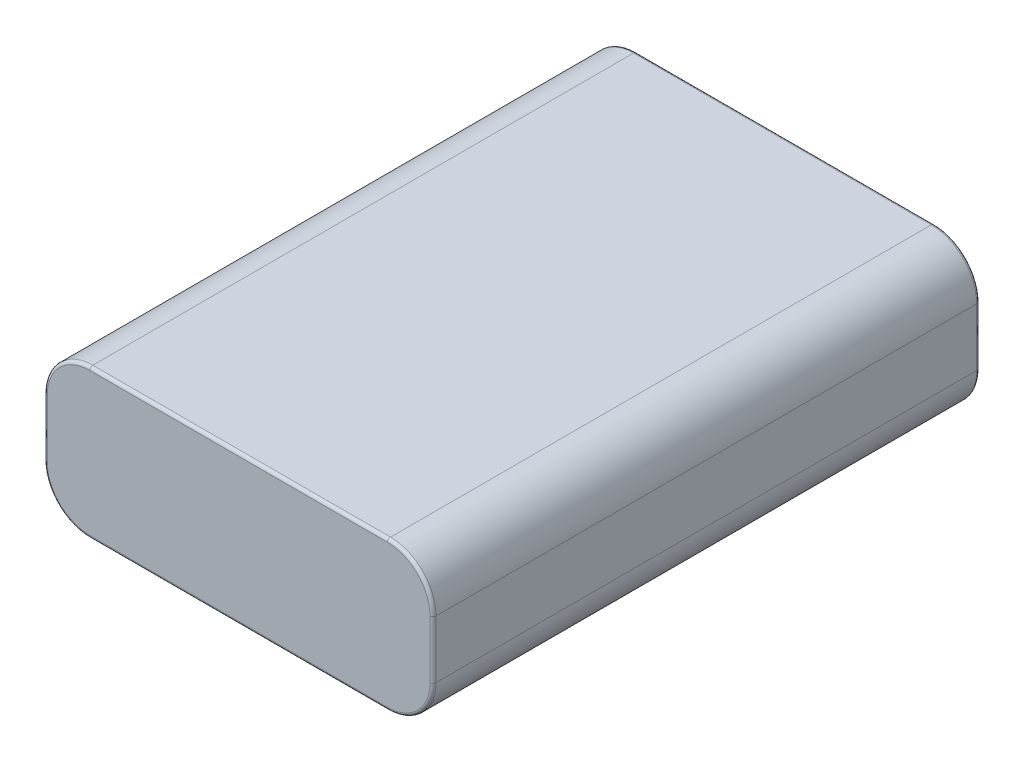
ISO-10303-21;
HEADER;
FILE_DESCRIPTION(('STEP AP214'),'2;1');
FILE_NAME('part.step','',(''),(''),'','','');
FILE_SCHEMA(('AUTOMOTIVE_DESIGN { 1 0 10303 214 1 1 1 1 }'));
ENDSEC;
DATA;
#1=APPLICATION_CONTEXT('core data for automotive mechanical design processes');
#2=APPLICATION_PROTOCOL_DEFINITION('international standard','automotive_design',2000,#1);
#3=PRODUCT_CONTEXT('',#1,'mechanical');
#4=PRODUCT('Part','Part','',(#3));
#5=PRODUCT_RELATED_PRODUCT_CATEGORY('part','',(#4));
#6=PRODUCT_DEFINITION_FORMATION('','',#4);
#7=PRODUCT_DEFINITION_CONTEXT('part definition',#1,'design');
#8=PRODUCT_DEFINITION('design','',#6,#7);
#9=PRODUCT_DEFINITION_SHAPE('','',#8);
#10=(LENGTH_UNIT() NAMED_UNIT(*) SI_UNIT(.MILLI.,.METRE.));
#11=(NAMED_UNIT(*) PLANE_ANGLE_UNIT() SI_UNIT($,.RADIAN.));
#12=(NAMED_UNIT(*) SI_UNIT($,.STERADIAN.) SOLID_ANGLE_UNIT());
#13=UNCERTAINTY_MEASURE_WITH_UNIT(LENGTH_MEASURE(1.E-05),#10,'distance_accuracy_value','');
#14=(GEOMETRIC_REPRESENTATION_CONTEXT(3) GLOBAL_UNCERTAINTY_ASSIGNED_CONTEXT((#13)) GLOBAL_UNIT_ASSIGNED_CONTEXT((#10,
#11,#12)) REPRESENTATION_CONTEXT('',''));
#15=CARTESIAN_POINT('',(0.,0.,0.));
#16=DIRECTION('',(0.,0.,1.));
#17=DIRECTION('',(1.,0.,0.));
#18=AXIS2_PLACEMENT_3D('',#15,#16,#17);
#19=CARTESIAN_POINT('',(32.,24.5,45.));
#20=DIRECTION('',(-1.,0.,0.));
#21=DIRECTION('',(0.,0.,1.));
#22=AXIS2_PLACEMENT_3D('',#19,#20,#21);
#23=PLANE('',#22);
#24=DIRECTION('',(0.,0.,-1.));
#25=VECTOR('',#24,1.);
#26=CARTESIAN_POINT('',(32.,7.5,-45.));
#27=LINE('',#26,#25);
#28=CARTESIAN_POINT('',(32.,7.5,44.5));
#29=VERTEX_POINT('',#28);
#30=CARTESIAN_POINT('',(32.,7.5,-44.5));
#31=VERTEX_POINT('',#30);
#32=EDGE_CURVE('E176',#29,#31,#27,.T.);
#33=ORIENTED_EDGE('',*,*,#32,.T.);
#34=DIRECTION('',(0.,-1.,0.));
#35=VECTOR('',#34,1.);
#36=CARTESIAN_POINT('',(32.,24.5,-44.5));
#37=LINE('',#36,#35);
#38=CARTESIAN_POINT('',(32.,17.,-44.5));
#39=VERTEX_POINT('',#38);
#40=EDGE_CURVE('E197',#31,#39,#37,.F.);
#41=ORIENTED_EDGE('',*,*,#40,.T.);
#42=DIRECTION('',(0.,0.,-1.));
#43=VECTOR('',#42,1.);
#44=CARTESIAN_POINT('',(32.,17.,45.));
#45=LINE('',#44,#43);
#46=CARTESIAN_POINT('',(32.,17.,44.5));
#47=VERTEX_POINT('',#46);
#48=EDGE_CURVE('E350',#39,#47,#45,.F.);
#49=ORIENTED_EDGE('',*,*,#48,.T.);
#50=DIRECTION('',(0.,-1.,0.));
#51=VECTOR('',#50,1.);
#52=CARTESIAN_POINT('',(32.,24.5,44.5));
#53=LINE('',#52,#51);
#54=EDGE_CURVE('E194',#47,#29,#53,.T.);
#55=ORIENTED_EDGE('',*,*,#54,.T.);
#56=EDGE_LOOP('',(#33,#41,#49,#55));
#57=FACE_BOUND('',#56,.T.);
#58=ADVANCED_FACE('F40',(#57),#23,.F.);
#59=CARTESIAN_POINT('',(-32.,24.5,-45.));
#60=DIRECTION('',(0.,0.,1.));
#61=DIRECTION('',(1.,0.,0.));
#62=AXIS2_PLACEMENT_3D('',#59,#60,#61);
#63=PLANE('',#62);
#64=DIRECTION('',(0.,-1.,0.));
#65=VECTOR('',#64,1.);
#66=CARTESIAN_POINT('',(31.5,24.5,-45.));
#67=LINE('',#66,#65);
#68=CARTESIAN_POINT('',(31.5,17.,-45.));
#69=VERTEX_POINT('',#68);
#70=CARTESIAN_POINT('',(31.5,7.5,-45.));
#71=VERTEX_POINT('',#70);
#72=EDGE_CURVE('E180',#69,#71,#67,.T.);
#73=ORIENTED_EDGE('',*,*,#72,.T.);
#74=CARTESIAN_POINT('',(24.5,7.5,-45.));
#75=DIRECTION('',(0.,0.,1.));
#76=DIRECTION('',(1.,0.,0.));
#77=AXIS2_PLACEMENT_3D('',#74,#75,#76);
#78=CIRCLE('',#77,7.);
#79=CARTESIAN_POINT('',(24.5,0.5,-45.));
#80=VERTEX_POINT('',#79);
#81=EDGE_CURVE('E159',#71,#80,#78,.F.);
#82=ORIENTED_EDGE('',*,*,#81,.T.);
#83=DIRECTION('',(-1.,0.,0.));
#84=VECTOR('',#83,1.);
#85=CARTESIAN_POINT('',(-24.5,0.5,-45.));
#86=LINE('',#85,#84);
#87=CARTESIAN_POINT('',(-24.5,0.5,-45.));
#88=VERTEX_POINT('',#87);
#89=EDGE_CURVE('E168',#80,#88,#86,.T.);
#90=ORIENTED_EDGE('',*,*,#89,.T.);
#91=CARTESIAN_POINT('',(-24.5,7.5,-45.));
#92=DIRECTION('',(0.,0.,1.));
#93=DIRECTION('',(1.,0.,0.));
#94=AXIS2_PLACEMENT_3D('',#91,#92,#93);
#95=CIRCLE('',#94,7.);
#96=CARTESIAN_POINT('',(-31.5,7.5,-45.));
#97=VERTEX_POINT('',#96);
#98=EDGE_CURVE('E175',#88,#97,#95,.F.);
#99=ORIENTED_EDGE('',*,*,#98,.T.);
#100=DIRECTION('',(0.,-1.,0.));
#101=VECTOR('',#100,1.);
#102=CARTESIAN_POINT('',(-31.5,24.5,-45.));
#103=LINE('',#102,#101);
#104=CARTESIAN_POINT('',(-31.5,17.,-45.));
#105=VERTEX_POINT('',#104);
#106=EDGE_CURVE('E358',#97,#105,#103,.F.);
#107=ORIENTED_EDGE('',*,*,#106,.T.);
#108=CARTESIAN_POINT('',(-24.5,17.,-45.));
#109=DIRECTION('',(0.,0.,1.));
#110=DIRECTION('',(1.,0.,0.));
#111=AXIS2_PLACEMENT_3D('',#108,#109,#110);
#112=CIRCLE('',#111,7.);
#113=CARTESIAN_POINT('',(-24.5,24.,-45.));
#114=VERTEX_POINT('',#113);
#115=EDGE_CURVE('E361',#105,#114,#112,.F.);
#116=ORIENTED_EDGE('',*,*,#115,.T.);
#117=DIRECTION('',(-1.,0.,0.));
#118=VECTOR('',#117,1.);
#119=CARTESIAN_POINT('',(-32.,24.,-45.));
#120=LINE('',#119,#118);
#121=CARTESIAN_POINT('',(24.5,24.,-45.));
#122=VERTEX_POINT('',#121);
#123=EDGE_CURVE('E364',#114,#122,#120,.F.);
#124=ORIENTED_EDGE('',*,*,#123,.T.);
#125=CARTESIAN_POINT('',(24.5,17.,-45.));
#126=DIRECTION('',(0.,0.,1.));
#127=DIRECTION('',(1.,0.,0.));
#128=AXIS2_PLACEMENT_3D('',#125,#126,#127);
#129=CIRCLE('',#128,7.);
#130=EDGE_CURVE('E188',#122,#69,#129,.F.);
#131=ORIENTED_EDGE('',*,*,#130,.T.);
#132=EDGE_LOOP('',(#73,#82,#90,#99,#107,#116,#124,#131));
#133=FACE_BOUND('',#132,.T.);
#134=ADVANCED_FACE('F178',(#133),#63,.F.);
#135=CARTESIAN_POINT('',(-32.,24.5,45.));
#136=DIRECTION('',(1.,0.,0.));
#137=DIRECTION('',(0.,0.,-1.));
#138=AXIS2_PLACEMENT_3D('',#135,#136,#137);
#139=PLANE('',#138);
#140=DIRECTION('',(0.,0.,1.));
#141=VECTOR('',#140,1.);
#142=CARTESIAN_POINT('',(-32.,17.,45.));
#143=LINE('',#142,#141);
#144=CARTESIAN_POINT('',(-32.,17.,44.5));
#145=VERTEX_POINT('',#144);
#146=CARTESIAN_POINT('',(-32.,17.,-44.5));
#147=VERTEX_POINT('',#146);
#148=EDGE_CURVE('E280',#145,#147,#143,.F.);
#149=ORIENTED_EDGE('',*,*,#148,.T.);
#150=DIRECTION('',(0.,-1.,0.));
#151=VECTOR('',#150,1.);
#152=CARTESIAN_POINT('',(-32.,24.5,-44.5));
#153=LINE('',#152,#151);
#154=CARTESIAN_POINT('',(-32.,7.5,-44.5));
#155=VERTEX_POINT('',#154);
#156=EDGE_CURVE('E222',#147,#155,#153,.T.);
#157=ORIENTED_EDGE('',*,*,#156,.T.);
#158=DIRECTION('',(0.,0.,1.));
#159=VECTOR('',#158,1.);
#160=CARTESIAN_POINT('',(-32.,7.5,45.));
#161=LINE('',#160,#159);
#162=CARTESIAN_POINT('',(-32.,7.5,44.5));
#163=VERTEX_POINT('',#162);
#164=EDGE_CURVE('E333',#155,#163,#161,.T.);
#165=ORIENTED_EDGE('',*,*,#164,.T.);
#166=DIRECTION('',(0.,-1.,0.));
#167=VECTOR('',#166,1.);
#168=CARTESIAN_POINT('',(-32.,24.5,44.5));
#169=LINE('',#168,#167);
#170=EDGE_CURVE('E219',#163,#145,#169,.F.);
#171=ORIENTED_EDGE('',*,*,#170,.T.);
#172=EDGE_LOOP('',(#149,#157,#165,#171));
#173=FACE_BOUND('',#172,.T.);
#174=ADVANCED_FACE('F407',(#173),#139,.F.);
#175=CARTESIAN_POINT('',(-32.,24.5,45.));
#176=DIRECTION('',(0.,0.,-1.));
#177=DIRECTION('',(-1.,0.,0.));
#178=AXIS2_PLACEMENT_3D('',#175,#176,#177);
#179=PLANE('',#178);
#180=DIRECTION('',(1.,0.,0.));
#181=VECTOR('',#180,1.);
#182=CARTESIAN_POINT('',(-32.,24.,45.));
#183=LINE('',#182,#181);
#184=CARTESIAN_POINT('',(24.5,24.,45.));
#185=VERTEX_POINT('',#184);
#186=CARTESIAN_POINT('',(-24.5,24.,45.));
#187=VERTEX_POINT('',#186);
#188=EDGE_CURVE('E50',#185,#187,#183,.F.);
#189=ORIENTED_EDGE('',*,*,#188,.T.);
#190=CARTESIAN_POINT('',(-24.5,17.,45.));
#191=DIRECTION('',(0.,0.,-1.));
#192=DIRECTION('',(-1.,0.,0.));
#193=AXIS2_PLACEMENT_3D('',#190,#191,#192);
#194=CIRCLE('',#193,7.);
#195=CARTESIAN_POINT('',(-31.5,17.,45.));
#196=VERTEX_POINT('',#195);
#197=EDGE_CURVE('E11',#187,#196,#194,.F.);
#198=ORIENTED_EDGE('',*,*,#197,.T.);
#199=DIRECTION('',(0.,-1.,0.));
#200=VECTOR('',#199,1.);
#201=CARTESIAN_POINT('',(-31.5,24.5,45.));
#202=LINE('',#201,#200);
#203=CARTESIAN_POINT('',(-31.5,7.5,45.));
#204=VERTEX_POINT('',#203);
#205=EDGE_CURVE('E237',#196,#204,#202,.T.);
#206=ORIENTED_EDGE('',*,*,#205,.T.);
#207=CARTESIAN_POINT('',(-24.5,7.5,45.));
#208=DIRECTION('',(0.,0.,-1.));
#209=DIRECTION('',(-1.,0.,0.));
#210=AXIS2_PLACEMENT_3D('',#207,#208,#209);
#211=CIRCLE('',#210,7.);
#212=CARTESIAN_POINT('',(-24.5,0.5,45.));
#213=VERTEX_POINT('',#212);
#214=EDGE_CURVE('E240',#204,#213,#211,.F.);
#215=ORIENTED_EDGE('',*,*,#214,.T.);
#216=DIRECTION('',(1.,0.,0.));
#217=VECTOR('',#216,1.);
#218=CARTESIAN_POINT('',(24.5,0.5,45.));
#219=LINE('',#218,#217);
#220=CARTESIAN_POINT('',(24.5,0.5,45.));
#221=VERTEX_POINT('',#220);
#222=EDGE_CURVE('E243',#213,#221,#219,.T.);
#223=ORIENTED_EDGE('',*,*,#222,.T.);
#224=CARTESIAN_POINT('',(24.5,7.5,45.));
#225=DIRECTION('',(0.,0.,-1.));
#226=DIRECTION('',(-1.,0.,0.));
#227=AXIS2_PLACEMENT_3D('',#224,#225,#226);
#228=CIRCLE('',#227,7.);
#229=CARTESIAN_POINT('',(31.5,7.5,45.));
#230=VERTEX_POINT('',#229);
#231=EDGE_CURVE('E246',#221,#230,#228,.F.);
#232=ORIENTED_EDGE('',*,*,#231,.T.);
#233=DIRECTION('',(0.,-1.,0.));
#234=VECTOR('',#233,1.);
#235=CARTESIAN_POINT('',(31.5,24.5,45.));
#236=LINE('',#235,#234);
#237=CARTESIAN_POINT('',(31.5,17.,45.));
#238=VERTEX_POINT('',#237);
#239=EDGE_CURVE('E249',#230,#238,#236,.F.);
#240=ORIENTED_EDGE('',*,*,#239,.T.);
#241=CARTESIAN_POINT('',(24.5,17.,45.));
#242=DIRECTION('',(0.,0.,-1.));
#243=DIRECTION('',(-1.,0.,0.));
#244=AXIS2_PLACEMENT_3D('',#241,#242,#243);
#245=CIRCLE('',#244,7.);
#246=EDGE_CURVE('E61',#238,#185,#245,.F.);
#247=ORIENTED_EDGE('',*,*,#246,.T.);
#248=EDGE_LOOP('',(#189,#198,#206,#215,#223,#232,#240,#247));
#249=FACE_BOUND('',#248,.T.);
#250=ADVANCED_FACE('F394',(#249),#179,.F.);
#251=CARTESIAN_POINT('',(0.,24.5,0.));
#252=DIRECTION('',(0.,-1.,0.));
#253=DIRECTION('',(0.,0.,-1.));
#254=AXIS2_PLACEMENT_3D('',#251,#252,#253);
#255=PLANE('',#254);
#256=DIRECTION('',(0.,0.,-1.));
#257=VECTOR('',#256,1.);
#258=CARTESIAN_POINT('',(24.5,24.5,0.));
#259=LINE('',#258,#257);
#260=CARTESIAN_POINT('',(24.5,24.5,44.5));
#261=VERTEX_POINT('',#260);
#262=CARTESIAN_POINT('',(24.5,24.5,-44.5));
#263=VERTEX_POINT('',#262);
#264=EDGE_CURVE('E337',#261,#263,#259,.T.);
#265=ORIENTED_EDGE('',*,*,#264,.T.);
#266=DIRECTION('',(-1.,0.,0.));
#267=VECTOR('',#266,1.);
#268=CARTESIAN_POINT('',(0.,24.5,-44.5));
#269=LINE('',#268,#267);
#270=CARTESIAN_POINT('',(-24.5,24.5,-44.5));
#271=VERTEX_POINT('',#270);
#272=EDGE_CURVE('E209',#263,#271,#269,.T.);
#273=ORIENTED_EDGE('',*,*,#272,.T.);
#274=DIRECTION('',(0.,0.,1.));
#275=VECTOR('',#274,1.);
#276=CARTESIAN_POINT('',(-24.5,24.5,0.));
#277=LINE('',#276,#275);
#278=CARTESIAN_POINT('',(-24.5,24.5,44.5));
#279=VERTEX_POINT('',#278);
#280=EDGE_CURVE('E346',#271,#279,#277,.T.);
#281=ORIENTED_EDGE('',*,*,#280,.T.);
#282=DIRECTION('',(1.,0.,0.));
#283=VECTOR('',#282,1.);
#284=CARTESIAN_POINT('',(0.,24.5,44.5));
#285=LINE('',#284,#283);
#286=EDGE_CURVE('E206',#279,#261,#285,.T.);
#287=ORIENTED_EDGE('',*,*,#286,.T.);
#288=EDGE_LOOP('',(#265,#273,#281,#287));
#289=FACE_BOUND('',#288,.T.);
#290=ADVANCED_FACE('F424',(#289),#255,.F.);
#291=CARTESIAN_POINT('',(0.,0.,0.));
#292=DIRECTION('',(0.,-1.,0.));
#293=DIRECTION('',(0.,0.,-1.));
#294=AXIS2_PLACEMENT_3D('',#291,#292,#293);
#295=PLANE('',#294);
#296=DIRECTION('',(0.,0.,1.));
#297=VECTOR('',#296,1.);
#298=CARTESIAN_POINT('',(-24.5,0.,-45.));
#299=LINE('',#298,#297);
#300=CARTESIAN_POINT('',(-24.5,0.,44.5));
#301=VERTEX_POINT('',#300);
#302=CARTESIAN_POINT('',(-24.5,0.,-44.5));
#303=VERTEX_POINT('',#302);
#304=EDGE_CURVE('E332',#301,#303,#299,.F.);
#305=ORIENTED_EDGE('',*,*,#304,.T.);
#306=DIRECTION('',(-1.,0.,0.));
#307=VECTOR('',#306,1.);
#308=CARTESIAN_POINT('',(24.5,0.,-44.5));
#309=LINE('',#308,#307);
#310=CARTESIAN_POINT('',(24.5,0.,-44.5));
#311=VERTEX_POINT('',#310);
#312=EDGE_CURVE('E234',#303,#311,#309,.F.);
#313=ORIENTED_EDGE('',*,*,#312,.T.);
#314=DIRECTION('',(0.,0.,-1.));
#315=VECTOR('',#314,1.);
#316=CARTESIAN_POINT('',(24.5,0.,45.));
#317=LINE('',#316,#315);
#318=CARTESIAN_POINT('',(24.5,0.,44.5));
#319=VERTEX_POINT('',#318);
#320=EDGE_CURVE('E325',#311,#319,#317,.F.);
#321=ORIENTED_EDGE('',*,*,#320,.T.);
#322=DIRECTION('',(1.,0.,0.));
#323=VECTOR('',#322,1.);
#324=CARTESIAN_POINT('',(-24.5,0.,44.5));
#325=LINE('',#324,#323);
#326=EDGE_CURVE('E231',#319,#301,#325,.F.);
#327=ORIENTED_EDGE('',*,*,#326,.T.);
#328=EDGE_LOOP('',(#305,#313,#321,#327));
#329=FACE_BOUND('',#328,.T.);
#330=ADVANCED_FACE('F329',(#329),#295,.T.);
#331=CARTESIAN_POINT('',(-24.5,7.5,45.));
#332=DIRECTION('',(0.,0.,-1.));
#333=DIRECTION('',(-1.,0.,0.));
#334=AXIS2_PLACEMENT_3D('',#331,#332,#333);
#335=CYLINDRICAL_SURFACE('',#334,7.5);
#336=ORIENTED_EDGE('',*,*,#164,.F.);
#337=CARTESIAN_POINT('',(-24.5,7.5,-44.5));
#338=DIRECTION('',(0.,0.,1.));
#339=DIRECTION('',(1.,0.,0.));
#340=AXIS2_PLACEMENT_3D('',#337,#338,#339);
#341=CIRCLE('',#340,7.5);
#342=EDGE_CURVE('E228',#155,#303,#341,.T.);
#343=ORIENTED_EDGE('',*,*,#342,.T.);
#344=ORIENTED_EDGE('',*,*,#304,.F.);
#345=CARTESIAN_POINT('',(-24.5,7.5,44.5));
#346=DIRECTION('',(0.,0.,-1.));
#347=DIRECTION('',(-1.,0.,0.));
#348=AXIS2_PLACEMENT_3D('',#345,#346,#347);
#349=CIRCLE('',#348,7.5);
#350=EDGE_CURVE('E225',#301,#163,#349,.T.);
#351=ORIENTED_EDGE('',*,*,#350,.T.);
#352=EDGE_LOOP('',(#336,#343,#344,#351));
#353=FACE_BOUND('',#352,.T.);
#354=ADVANCED_FACE('F430',(#353),#335,.T.);
#355=CARTESIAN_POINT('',(-24.5,17.,0.));
#356=DIRECTION('',(0.,0.,1.));
#357=DIRECTION('',(1.,0.,0.));
#358=AXIS2_PLACEMENT_3D('',#355,#356,#357);
#359=CYLINDRICAL_SURFACE('',#358,7.5);
#360=ORIENTED_EDGE('',*,*,#280,.F.);
#361=CARTESIAN_POINT('',(-24.5,17.,-44.5));
#362=DIRECTION('',(0.,0.,1.));
#363=DIRECTION('',(1.,0.,0.));
#364=AXIS2_PLACEMENT_3D('',#361,#362,#363);
#365=CIRCLE('',#364,7.5);
#366=EDGE_CURVE('E216',#271,#147,#365,.T.);
#367=ORIENTED_EDGE('',*,*,#366,.T.);
#368=ORIENTED_EDGE('',*,*,#148,.F.);
#369=CARTESIAN_POINT('',(-24.5,17.,44.5));
#370=DIRECTION('',(0.,0.,-1.));
#371=DIRECTION('',(-1.,0.,0.));
#372=AXIS2_PLACEMENT_3D('',#369,#370,#371);
#373=CIRCLE('',#372,7.5);
#374=EDGE_CURVE('E212',#145,#279,#373,.T.);
#375=ORIENTED_EDGE('',*,*,#374,.T.);
#376=EDGE_LOOP('',(#360,#367,#368,#375));
#377=FACE_BOUND('',#376,.T.);
#378=ADVANCED_FACE('F412',(#377),#359,.T.);
#379=CARTESIAN_POINT('',(24.5,7.5,45.));
#380=DIRECTION('',(0.,0.,1.));
#381=DIRECTION('',(1.,0.,0.));
#382=AXIS2_PLACEMENT_3D('',#379,#380,#381);
#383=CYLINDRICAL_SURFACE('',#382,7.5);
#384=ORIENTED_EDGE('',*,*,#320,.F.);
#385=CARTESIAN_POINT('',(24.5,7.5,-44.5));
#386=DIRECTION('',(0.,0.,1.));
#387=DIRECTION('',(1.,0.,0.));
#388=AXIS2_PLACEMENT_3D('',#385,#386,#387);
#389=CIRCLE('',#388,7.5);
#390=EDGE_CURVE('E161',#311,#31,#389,.T.);
#391=ORIENTED_EDGE('',*,*,#390,.T.);
#392=ORIENTED_EDGE('',*,*,#32,.F.);
#393=CARTESIAN_POINT('',(24.5,7.5,44.5));
#394=DIRECTION('',(0.,0.,-1.));
#395=DIRECTION('',(-1.,0.,0.));
#396=AXIS2_PLACEMENT_3D('',#393,#394,#395);
#397=CIRCLE('',#396,7.5);
#398=EDGE_CURVE('E183',#29,#319,#397,.T.);
#399=ORIENTED_EDGE('',*,*,#398,.T.);
#400=EDGE_LOOP('',(#384,#391,#392,#399));
#401=FACE_BOUND('',#400,.T.);
#402=ADVANCED_FACE('F324',(#401),#383,.T.);
#403=CARTESIAN_POINT('',(24.5,17.,0.));
#404=DIRECTION('',(0.,0.,-1.));
#405=DIRECTION('',(-1.,0.,0.));
#406=AXIS2_PLACEMENT_3D('',#403,#404,#405);
#407=CYLINDRICAL_SURFACE('',#406,7.5);
#408=ORIENTED_EDGE('',*,*,#48,.F.);
#409=CARTESIAN_POINT('',(24.5,17.,-44.5));
#410=DIRECTION('',(0.,0.,1.));
#411=DIRECTION('',(1.,0.,0.));
#412=AXIS2_PLACEMENT_3D('',#409,#410,#411);
#413=CIRCLE('',#412,7.5);
#414=EDGE_CURVE('E203',#39,#263,#413,.T.);
#415=ORIENTED_EDGE('',*,*,#414,.T.);
#416=ORIENTED_EDGE('',*,*,#264,.F.);
#417=CARTESIAN_POINT('',(24.5,17.,44.5));
#418=DIRECTION('',(0.,0.,-1.));
#419=DIRECTION('',(-1.,0.,0.));
#420=AXIS2_PLACEMENT_3D('',#417,#418,#419);
#421=CIRCLE('',#420,7.5);
#422=EDGE_CURVE('E200',#261,#47,#421,.T.);
#423=ORIENTED_EDGE('',*,*,#422,.T.);
#424=EDGE_LOOP('',(#408,#415,#416,#423));
#425=FACE_BOUND('',#424,.T.);
#426=ADVANCED_FACE('F380',(#425),#407,.T.);
#427=CARTESIAN_POINT('',(-24.5,17.,-44.5));
#428=DIRECTION('',(0.,0.,1.));
#429=DIRECTION('',(1.,0.,0.));
#430=AXIS2_PLACEMENT_3D('',#427,#428,#429);
#431=TOROIDAL_SURFACE('',#430,7.,0.5);
#432=CARTESIAN_POINT('',(-31.5,17.,-44.5));
#433=DIRECTION('',(0.,-1.,0.));
#434=DIRECTION('',(0.,0.,-1.));
#435=AXIS2_PLACEMENT_3D('',#432,#433,#434);
#436=CIRCLE('',#435,0.5);
#437=EDGE_CURVE('E272',#147,#105,#436,.T.);
#438=ORIENTED_EDGE('',*,*,#437,.F.);
#439=ORIENTED_EDGE('',*,*,#366,.F.);
#440=CARTESIAN_POINT('',(-24.5,24.,-44.5));
#441=DIRECTION('',(1.,0.,0.));
#442=DIRECTION('',(0.,0.,-1.));
#443=AXIS2_PLACEMENT_3D('',#440,#441,#442);
#444=CIRCLE('',#443,0.5);
#445=EDGE_CURVE('E276',#114,#271,#444,.T.);
#446=ORIENTED_EDGE('',*,*,#445,.F.);
#447=ORIENTED_EDGE('',*,*,#115,.F.);
#448=EDGE_LOOP('',(#438,#439,#446,#447));
#449=FACE_BOUND('',#448,.T.);
#450=ADVANCED_FACE('F417',(#449),#431,.T.);
#451=CARTESIAN_POINT('',(0.,24.,-44.5));
#452=DIRECTION('',(-1.,0.,0.));
#453=DIRECTION('',(0.,0.,1.));
#454=AXIS2_PLACEMENT_3D('',#451,#452,#453);
#455=CYLINDRICAL_SURFACE('',#454,0.5);
#456=ORIENTED_EDGE('',*,*,#445,.T.);
#457=ORIENTED_EDGE('',*,*,#272,.F.);
#458=CARTESIAN_POINT('',(24.5,24.,-44.5));
#459=DIRECTION('',(1.,0.,0.));
#460=DIRECTION('',(0.,0.,-1.));
#461=AXIS2_PLACEMENT_3D('',#458,#459,#460);
#462=CIRCLE('',#461,0.5);
#463=EDGE_CURVE('E268',#122,#263,#462,.T.);
#464=ORIENTED_EDGE('',*,*,#463,.F.);
#465=ORIENTED_EDGE('',*,*,#123,.F.);
#466=EDGE_LOOP('',(#456,#457,#464,#465));
#467=FACE_BOUND('',#466,.T.);
#468=ADVANCED_FACE('F422',(#467),#455,.T.);
#469=CARTESIAN_POINT('',(-31.5,24.5,-44.5));
#470=DIRECTION('',(0.,-1.,0.));
#471=DIRECTION('',(0.,0.,-1.));
#472=AXIS2_PLACEMENT_3D('',#469,#470,#471);
#473=CYLINDRICAL_SURFACE('',#472,0.5);
#474=ORIENTED_EDGE('',*,*,#437,.T.);
#475=ORIENTED_EDGE('',*,*,#106,.F.);
#476=CARTESIAN_POINT('',(-31.5,7.5,-44.5));
#477=DIRECTION('',(0.,-1.,0.));
#478=DIRECTION('',(0.,0.,-1.));
#479=AXIS2_PLACEMENT_3D('',#476,#477,#478);
#480=CIRCLE('',#479,0.5);
#481=EDGE_CURVE('E264',#155,#97,#480,.T.);
#482=ORIENTED_EDGE('',*,*,#481,.F.);
#483=ORIENTED_EDGE('',*,*,#156,.F.);
#484=EDGE_LOOP('',(#474,#475,#482,#483));
#485=FACE_BOUND('',#484,.T.);
#486=ADVANCED_FACE('F463',(#485),#473,.T.);
#487=CARTESIAN_POINT('',(24.5,17.,-44.5));
#488=DIRECTION('',(0.,0.,1.));
#489=DIRECTION('',(1.,0.,0.));
#490=AXIS2_PLACEMENT_3D('',#487,#488,#489);
#491=TOROIDAL_SURFACE('',#490,7.,0.5);
#492=ORIENTED_EDGE('',*,*,#463,.T.);
#493=ORIENTED_EDGE('',*,*,#414,.F.);
#494=CARTESIAN_POINT('',(31.5,17.,-44.5));
#495=DIRECTION('',(0.,-1.,0.));
#496=DIRECTION('',(0.,0.,-1.));
#497=AXIS2_PLACEMENT_3D('',#494,#495,#496);
#498=CIRCLE('',#497,0.5);
#499=EDGE_CURVE('E260',#69,#39,#498,.T.);
#500=ORIENTED_EDGE('',*,*,#499,.F.);
#501=ORIENTED_EDGE('',*,*,#130,.F.);
#502=EDGE_LOOP('',(#492,#493,#500,#501));
#503=FACE_BOUND('',#502,.T.);
#504=ADVANCED_FACE('F373',(#503),#491,.T.);
#505=CARTESIAN_POINT('',(-24.5,7.5,-44.5));
#506=DIRECTION('',(0.,0.,1.));
#507=DIRECTION('',(1.,0.,0.));
#508=AXIS2_PLACEMENT_3D('',#505,#506,#507);
#509=TOROIDAL_SURFACE('',#508,7.,0.5);
#510=ORIENTED_EDGE('',*,*,#481,.T.);
#511=ORIENTED_EDGE('',*,*,#98,.F.);
#512=CARTESIAN_POINT('',(-24.5,0.5,-44.5));
#513=DIRECTION('',(1.,0.,0.));
#514=DIRECTION('',(0.,0.,-1.));
#515=AXIS2_PLACEMENT_3D('',#512,#513,#514);
#516=CIRCLE('',#515,0.5);
#517=EDGE_CURVE('E171',#303,#88,#516,.T.);
#518=ORIENTED_EDGE('',*,*,#517,.F.);
#519=ORIENTED_EDGE('',*,*,#342,.F.);
#520=EDGE_LOOP('',(#510,#511,#518,#519));
#521=FACE_BOUND('',#520,.T.);
#522=ADVANCED_FACE('F457',(#521),#509,.T.);
#523=CARTESIAN_POINT('',(31.5,24.5,-44.5));
#524=DIRECTION('',(0.,-1.,0.));
#525=DIRECTION('',(0.,0.,-1.));
#526=AXIS2_PLACEMENT_3D('',#523,#524,#525);
#527=CYLINDRICAL_SURFACE('',#526,0.5);
#528=ORIENTED_EDGE('',*,*,#499,.T.);
#529=ORIENTED_EDGE('',*,*,#40,.F.);
#530=CARTESIAN_POINT('',(31.5,7.5,-44.5));
#531=DIRECTION('',(0.,-1.,0.));
#532=DIRECTION('',(0.,0.,-1.));
#533=AXIS2_PLACEMENT_3D('',#530,#531,#532);
#534=CIRCLE('',#533,0.5);
#535=EDGE_CURVE('E165',#71,#31,#534,.T.);
#536=ORIENTED_EDGE('',*,*,#535,.F.);
#537=ORIENTED_EDGE('',*,*,#72,.F.);
#538=EDGE_LOOP('',(#528,#529,#536,#537));
#539=FACE_BOUND('',#538,.T.);
#540=ADVANCED_FACE('F376',(#539),#527,.T.);
#541=CARTESIAN_POINT('',(-32.,0.5,-44.5));
#542=DIRECTION('',(1.,0.,0.));
#543=DIRECTION('',(0.,0.,-1.));
#544=AXIS2_PLACEMENT_3D('',#541,#542,#543);
#545=CYLINDRICAL_SURFACE('',#544,0.5);
#546=ORIENTED_EDGE('',*,*,#517,.T.);
#547=ORIENTED_EDGE('',*,*,#89,.F.);
#548=CARTESIAN_POINT('',(24.5,0.5,-44.5));
#549=DIRECTION('',(1.,0.,0.));
#550=DIRECTION('',(0.,0.,-1.));
#551=AXIS2_PLACEMENT_3D('',#548,#549,#550);
#552=CIRCLE('',#551,0.5);
#553=EDGE_CURVE('E155',#311,#80,#552,.T.);
#554=ORIENTED_EDGE('',*,*,#553,.F.);
#555=ORIENTED_EDGE('',*,*,#312,.F.);
#556=EDGE_LOOP('',(#546,#547,#554,#555));
#557=FACE_BOUND('',#556,.T.);
#558=ADVANCED_FACE('F169',(#557),#545,.T.);
#559=CARTESIAN_POINT('',(24.5,7.5,-44.5));
#560=DIRECTION('',(0.,0.,1.));
#561=DIRECTION('',(1.,0.,0.));
#562=AXIS2_PLACEMENT_3D('',#559,#560,#561);
#563=TOROIDAL_SURFACE('',#562,7.,0.5);
#564=ORIENTED_EDGE('',*,*,#535,.T.);
#565=ORIENTED_EDGE('',*,*,#390,.F.);
#566=ORIENTED_EDGE('',*,*,#553,.T.);
#567=ORIENTED_EDGE('',*,*,#81,.F.);
#568=EDGE_LOOP('',(#564,#565,#566,#567));
#569=FACE_BOUND('',#568,.T.);
#570=ADVANCED_FACE('F157',(#569),#563,.T.);
#571=CARTESIAN_POINT('',(24.5,7.5,44.5));
#572=DIRECTION('',(0.,0.,-1.));
#573=DIRECTION('',(-1.,0.,0.));
#574=AXIS2_PLACEMENT_3D('',#571,#572,#573);
#575=TOROIDAL_SURFACE('',#574,7.,0.5);
#576=CARTESIAN_POINT('',(24.5,0.5,44.5));
#577=DIRECTION('',(-1.,0.,0.));
#578=DIRECTION('',(0.,0.,1.));
#579=AXIS2_PLACEMENT_3D('',#576,#577,#578);
#580=CIRCLE('',#579,0.5);
#581=EDGE_CURVE('E302',#319,#221,#580,.T.);
#582=ORIENTED_EDGE('',*,*,#581,.F.);
#583=ORIENTED_EDGE('',*,*,#398,.F.);
#584=CARTESIAN_POINT('',(31.5,7.5,44.5));
#585=DIRECTION('',(0.,1.,0.));
#586=DIRECTION('',(0.,0.,1.));
#587=AXIS2_PLACEMENT_3D('',#584,#585,#586);
#588=CIRCLE('',#587,0.5);
#589=EDGE_CURVE('E44',#230,#29,#588,.T.);
#590=ORIENTED_EDGE('',*,*,#589,.F.);
#591=ORIENTED_EDGE('',*,*,#231,.F.);
#592=EDGE_LOOP('',(#582,#583,#590,#591));
#593=FACE_BOUND('',#592,.T.);
#594=ADVANCED_FACE('F42',(#593),#575,.T.);
#595=CARTESIAN_POINT('',(31.5,24.5,44.5));
#596=DIRECTION('',(0.,-1.,0.));
#597=DIRECTION('',(0.,0.,-1.));
#598=AXIS2_PLACEMENT_3D('',#595,#596,#597);
#599=CYLINDRICAL_SURFACE('',#598,0.5);
#600=ORIENTED_EDGE('',*,*,#589,.T.);
#601=ORIENTED_EDGE('',*,*,#54,.F.);
#602=CARTESIAN_POINT('',(31.5,17.,44.5));
#603=DIRECTION('',(0.,1.,0.));
#604=DIRECTION('',(0.,0.,1.));
#605=AXIS2_PLACEMENT_3D('',#602,#603,#604);
#606=CIRCLE('',#605,0.5);
#607=EDGE_CURVE('E299',#238,#47,#606,.T.);
#608=ORIENTED_EDGE('',*,*,#607,.F.);
#609=ORIENTED_EDGE('',*,*,#239,.F.);
#610=EDGE_LOOP('',(#600,#601,#608,#609));
#611=FACE_BOUND('',#610,.T.);
#612=ADVANCED_FACE('F315',(#611),#599,.T.);
#613=CARTESIAN_POINT('',(-32.,0.5,44.5));
#614=DIRECTION('',(-1.,0.,0.));
#615=DIRECTION('',(0.,0.,1.));
#616=AXIS2_PLACEMENT_3D('',#613,#614,#615);
#617=CYLINDRICAL_SURFACE('',#616,0.5);
#618=ORIENTED_EDGE('',*,*,#581,.T.);
#619=ORIENTED_EDGE('',*,*,#222,.F.);
#620=CARTESIAN_POINT('',(-24.5,0.5,44.5));
#621=DIRECTION('',(-1.,0.,0.));
#622=DIRECTION('',(0.,0.,1.));
#623=AXIS2_PLACEMENT_3D('',#620,#621,#622);
#624=CIRCLE('',#623,0.5);
#625=EDGE_CURVE('E295',#301,#213,#624,.T.);
#626=ORIENTED_EDGE('',*,*,#625,.F.);
#627=ORIENTED_EDGE('',*,*,#326,.F.);
#628=EDGE_LOOP('',(#618,#619,#626,#627));
#629=FACE_BOUND('',#628,.T.);
#630=ADVANCED_FACE('F481',(#629),#617,.T.);
#631=CARTESIAN_POINT('',(24.5,17.,44.5));
#632=DIRECTION('',(0.,0.,-1.));
#633=DIRECTION('',(-1.,0.,0.));
#634=AXIS2_PLACEMENT_3D('',#631,#632,#633);
#635=TOROIDAL_SURFACE('',#634,7.,0.5);
#636=ORIENTED_EDGE('',*,*,#607,.T.);
#637=ORIENTED_EDGE('',*,*,#422,.F.);
#638=CARTESIAN_POINT('',(24.5,24.,44.5));
#639=DIRECTION('',(-1.,0.,0.));
#640=DIRECTION('',(0.,0.,1.));
#641=AXIS2_PLACEMENT_3D('',#638,#639,#640);
#642=CIRCLE('',#641,0.5);
#643=EDGE_CURVE('E291',#185,#261,#642,.T.);
#644=ORIENTED_EDGE('',*,*,#643,.F.);
#645=ORIENTED_EDGE('',*,*,#246,.F.);
#646=EDGE_LOOP('',(#636,#637,#644,#645));
#647=FACE_BOUND('',#646,.T.);
#648=ADVANCED_FACE('F384',(#647),#635,.T.);
#649=CARTESIAN_POINT('',(-24.5,7.5,44.5));
#650=DIRECTION('',(0.,0.,-1.));
#651=DIRECTION('',(-1.,0.,0.));
#652=AXIS2_PLACEMENT_3D('',#649,#650,#651);
#653=TOROIDAL_SURFACE('',#652,7.,0.5);
#654=ORIENTED_EDGE('',*,*,#625,.T.);
#655=ORIENTED_EDGE('',*,*,#214,.F.);
#656=CARTESIAN_POINT('',(-31.5,7.5,44.5));
#657=DIRECTION('',(0.,1.,0.));
#658=DIRECTION('',(0.,0.,1.));
#659=AXIS2_PLACEMENT_3D('',#656,#657,#658);
#660=CIRCLE('',#659,0.5);
#661=EDGE_CURVE('E287',#163,#204,#660,.T.);
#662=ORIENTED_EDGE('',*,*,#661,.F.);
#663=ORIENTED_EDGE('',*,*,#350,.F.);
#664=EDGE_LOOP('',(#654,#655,#662,#663));
#665=FACE_BOUND('',#664,.T.);
#666=ADVANCED_FACE('F399',(#665),#653,.T.);
#667=CARTESIAN_POINT('',(0.,24.,44.5));
#668=DIRECTION('',(1.,0.,0.));
#669=DIRECTION('',(0.,0.,-1.));
#670=AXIS2_PLACEMENT_3D('',#667,#668,#669);
#671=CYLINDRICAL_SURFACE('',#670,0.5);
#672=ORIENTED_EDGE('',*,*,#643,.T.);
#673=ORIENTED_EDGE('',*,*,#286,.F.);
#674=CARTESIAN_POINT('',(-24.5,24.,44.5));
#675=DIRECTION('',(-1.,0.,0.));
#676=DIRECTION('',(0.,0.,1.));
#677=AXIS2_PLACEMENT_3D('',#674,#675,#676);
#678=CIRCLE('',#677,0.5);
#679=EDGE_CURVE('E284',#187,#279,#678,.T.);
#680=ORIENTED_EDGE('',*,*,#679,.F.);
#681=ORIENTED_EDGE('',*,*,#188,.F.);
#682=EDGE_LOOP('',(#672,#673,#680,#681));
#683=FACE_BOUND('',#682,.T.);
#684=ADVANCED_FACE('F387',(#683),#671,.T.);
#685=CARTESIAN_POINT('',(-31.5,24.5,44.5));
#686=DIRECTION('',(0.,-1.,0.));
#687=DIRECTION('',(0.,0.,-1.));
#688=AXIS2_PLACEMENT_3D('',#685,#686,#687);
#689=CYLINDRICAL_SURFACE('',#688,0.5);
#690=ORIENTED_EDGE('',*,*,#661,.T.);
#691=ORIENTED_EDGE('',*,*,#205,.F.);
#692=CARTESIAN_POINT('',(-31.5,17.,44.5));
#693=DIRECTION('',(0.,1.,0.));
#694=DIRECTION('',(0.,0.,1.));
#695=AXIS2_PLACEMENT_3D('',#692,#693,#694);
#696=CIRCLE('',#695,0.5);
#697=EDGE_CURVE('E281',#145,#196,#696,.T.);
#698=ORIENTED_EDGE('',*,*,#697,.F.);
#699=ORIENTED_EDGE('',*,*,#170,.F.);
#700=EDGE_LOOP('',(#690,#691,#698,#699));
#701=FACE_BOUND('',#700,.T.);
#702=ADVANCED_FACE('F403',(#701),#689,.T.);
#703=CARTESIAN_POINT('',(-24.5,17.,44.5));
#704=DIRECTION('',(0.,0.,-1.));
#705=DIRECTION('',(-1.,0.,0.));
#706=AXIS2_PLACEMENT_3D('',#703,#704,#705);
#707=TOROIDAL_SURFACE('',#706,7.,0.5);
#708=ORIENTED_EDGE('',*,*,#679,.T.);
#709=ORIENTED_EDGE('',*,*,#374,.F.);
#710=ORIENTED_EDGE('',*,*,#697,.T.);
#711=ORIENTED_EDGE('',*,*,#197,.F.);
#712=EDGE_LOOP('',(#708,#709,#710,#711));
#713=FACE_BOUND('',#712,.T.);
#714=ADVANCED_FACE('F391',(#713),#707,.T.);
#715=CLOSED_SHELL('',(#58,#134,#174,#250,#290,#330,#354,#378,#402,#426,#450,#468,#486,#504,#522,
#540,#558,#570,#594,#612,#630,#648,#666,#684,#702,#714));
#716=MANIFOLD_SOLID_BREP('B2',#715);
#717=ADVANCED_BREP_SHAPE_REPRESENTATION('',(#18,#716),#14);
#718=SHAPE_DEFINITION_REPRESENTATION(#9,#717);
ENDSEC;
END-ISO-10303-21;
